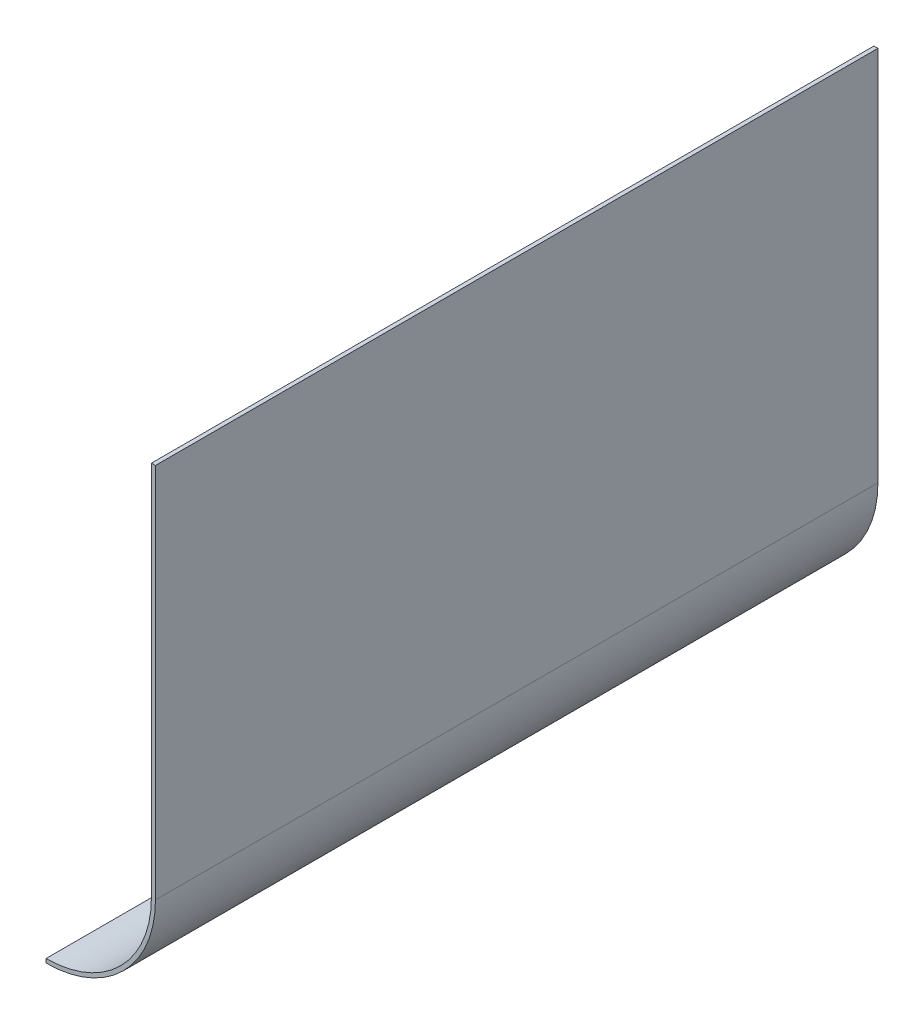
ISO-10303-21;
HEADER;
FILE_DESCRIPTION(('STEP AP214'),'2;1');
FILE_NAME('part.step','',(''),(''),'','','');
FILE_SCHEMA(('AUTOMOTIVE_DESIGN { 1 0 10303 214 1 1 1 1 }'));
ENDSEC;
DATA;
#1=APPLICATION_CONTEXT('core data for automotive mechanical design processes');
#2=APPLICATION_PROTOCOL_DEFINITION('international standard','automotive_design',2000,#1);
#3=PRODUCT_CONTEXT('',#1,'mechanical');
#4=PRODUCT('Part','Part','',(#3));
#5=PRODUCT_RELATED_PRODUCT_CATEGORY('part','',(#4));
#6=PRODUCT_DEFINITION_FORMATION('','',#4);
#7=PRODUCT_DEFINITION_CONTEXT('part definition',#1,'design');
#8=PRODUCT_DEFINITION('design','',#6,#7);
#9=PRODUCT_DEFINITION_SHAPE('','',#8);
#10=(LENGTH_UNIT() NAMED_UNIT(*) SI_UNIT(.MILLI.,.METRE.));
#11=(NAMED_UNIT(*) PLANE_ANGLE_UNIT() SI_UNIT($,.RADIAN.));
#12=(NAMED_UNIT(*) SI_UNIT($,.STERADIAN.) SOLID_ANGLE_UNIT());
#13=UNCERTAINTY_MEASURE_WITH_UNIT(LENGTH_MEASURE(1.E-05),#10,'distance_accuracy_value','');
#14=(GEOMETRIC_REPRESENTATION_CONTEXT(3) GLOBAL_UNCERTAINTY_ASSIGNED_CONTEXT((#13)) GLOBAL_UNIT_ASSIGNED_CONTEXT((#10,
#11,#12)) REPRESENTATION_CONTEXT('',''));
#15=CARTESIAN_POINT('',(0.,0.,0.));
#16=DIRECTION('',(0.,0.,1.));
#17=DIRECTION('',(1.,0.,0.));
#18=AXIS2_PLACEMENT_3D('',#15,#16,#17);
#19=CARTESIAN_POINT('',(69.215,238.125,457.2));
#20=DIRECTION('',(-1.,0.,0.));
#21=DIRECTION('',(0.,-1.,0.));
#22=AXIS2_PLACEMENT_3D('',#19,#20,#21);
#23=PLANE('',#22);
#24=DIRECTION('',(0.,1.,0.));
#25=VECTOR('',#24,1.);
#26=CARTESIAN_POINT('',(69.215,238.125,0.));
#27=LINE('',#26,#25);
#28=CARTESIAN_POINT('',(69.215,0.,0.));
#29=VERTEX_POINT('',#28);
#30=CARTESIAN_POINT('',(69.215,238.125,0.));
#31=VERTEX_POINT('',#30);
#32=EDGE_CURVE('E114',#29,#31,#27,.T.);
#33=ORIENTED_EDGE('',*,*,#32,.T.);
#34=DIRECTION('',(0.,0.,-1.));
#35=VECTOR('',#34,1.);
#36=CARTESIAN_POINT('',(69.215,238.125,457.2));
#37=LINE('',#36,#35);
#38=CARTESIAN_POINT('',(69.215,238.125,457.2));
#39=VERTEX_POINT('',#38);
#40=EDGE_CURVE('E11',#39,#31,#37,.T.);
#41=ORIENTED_EDGE('',*,*,#40,.F.);
#42=DIRECTION('',(0.,1.,0.));
#43=VECTOR('',#42,1.);
#44=CARTESIAN_POINT('',(69.215,238.125,457.2));
#45=LINE('',#44,#43);
#46=CARTESIAN_POINT('',(69.215,0.,457.2));
#47=VERTEX_POINT('',#46);
#48=EDGE_CURVE('E79',#47,#39,#45,.T.);
#49=ORIENTED_EDGE('',*,*,#48,.F.);
#50=DIRECTION('',(0.,0.,-1.));
#51=VECTOR('',#50,1.);
#52=CARTESIAN_POINT('',(69.215,0.,457.2));
#53=LINE('',#52,#51);
#54=EDGE_CURVE('E110',#47,#29,#53,.T.);
#55=ORIENTED_EDGE('',*,*,#54,.T.);
#56=EDGE_LOOP('',(#33,#41,#49,#55));
#57=FACE_BOUND('',#56,.T.);
#58=ADVANCED_FACE('F33',(#57),#23,.F.);
#59=CARTESIAN_POINT('',(66.675,238.125,457.2));
#60=DIRECTION('',(0.,1.,0.));
#61=DIRECTION('',(0.,0.,1.));
#62=AXIS2_PLACEMENT_3D('',#59,#60,#61);
#63=PLANE('',#62);
#64=DIRECTION('',(1.,0.,0.));
#65=VECTOR('',#64,1.);
#66=CARTESIAN_POINT('',(66.675,238.125,0.));
#67=LINE('',#66,#65);
#68=CARTESIAN_POINT('',(66.675,238.125,0.));
#69=VERTEX_POINT('',#68);
#70=EDGE_CURVE('E117',#69,#31,#67,.T.);
#71=ORIENTED_EDGE('',*,*,#70,.F.);
#72=DIRECTION('',(0.,0.,-1.));
#73=VECTOR('',#72,1.);
#74=CARTESIAN_POINT('',(66.675,238.125,457.2));
#75=LINE('',#74,#73);
#76=CARTESIAN_POINT('',(66.675,238.125,457.2));
#77=VERTEX_POINT('',#76);
#78=EDGE_CURVE('E41',#77,#69,#75,.T.);
#79=ORIENTED_EDGE('',*,*,#78,.F.);
#80=DIRECTION('',(1.,0.,0.));
#81=VECTOR('',#80,1.);
#82=CARTESIAN_POINT('',(66.675,238.125,457.2));
#83=LINE('',#82,#81);
#84=EDGE_CURVE('E203',#77,#39,#83,.T.);
#85=ORIENTED_EDGE('',*,*,#84,.T.);
#86=ORIENTED_EDGE('',*,*,#40,.T.);
#87=EDGE_LOOP('',(#71,#79,#85,#86));
#88=FACE_BOUND('',#87,.T.);
#89=ADVANCED_FACE('F135',(#88),#63,.T.);
#90=CARTESIAN_POINT('',(66.675,238.125,457.2));
#91=DIRECTION('',(-1.,0.,0.));
#92=DIRECTION('',(0.,-1.,0.));
#93=AXIS2_PLACEMENT_3D('',#90,#91,#92);
#94=PLANE('',#93);
#95=DIRECTION('',(0.,1.,0.));
#96=VECTOR('',#95,1.);
#97=CARTESIAN_POINT('',(66.675,238.125,0.));
#98=LINE('',#97,#96);
#99=CARTESIAN_POINT('',(66.675,0.,0.));
#100=VERTEX_POINT('',#99);
#101=EDGE_CURVE('E120',#100,#69,#98,.T.);
#102=ORIENTED_EDGE('',*,*,#101,.F.);
#103=DIRECTION('',(0.,0.,-1.));
#104=VECTOR('',#103,1.);
#105=CARTESIAN_POINT('',(66.675,0.,457.2));
#106=LINE('',#105,#104);
#107=CARTESIAN_POINT('',(66.675,0.,457.2));
#108=VERTEX_POINT('',#107);
#109=EDGE_CURVE('E100',#108,#100,#106,.T.);
#110=ORIENTED_EDGE('',*,*,#109,.F.);
#111=DIRECTION('',(0.,1.,0.));
#112=VECTOR('',#111,1.);
#113=CARTESIAN_POINT('',(66.675,238.125,457.2));
#114=LINE('',#113,#112);
#115=EDGE_CURVE('E106',#108,#77,#114,.T.);
#116=ORIENTED_EDGE('',*,*,#115,.T.);
#117=ORIENTED_EDGE('',*,*,#78,.T.);
#118=EDGE_LOOP('',(#102,#110,#116,#117));
#119=FACE_BOUND('',#118,.T.);
#120=ADVANCED_FACE('F132',(#119),#94,.T.);
#121=CARTESIAN_POINT('',(0.,0.,457.2));
#122=DIRECTION('',(0.,0.,-1.));
#123=DIRECTION('',(-1.,0.,0.));
#124=AXIS2_PLACEMENT_3D('',#121,#122,#123);
#125=CYLINDRICAL_SURFACE('',#124,66.675);
#126=CARTESIAN_POINT('',(0.,0.,0.));
#127=DIRECTION('',(0.,0.,1.));
#128=DIRECTION('',(1.,0.,0.));
#129=AXIS2_PLACEMENT_3D('',#126,#127,#128);
#130=CIRCLE('',#129,66.675);
#131=CARTESIAN_POINT('',(0.,-66.675,0.));
#132=VERTEX_POINT('',#131);
#133=EDGE_CURVE('E95',#132,#100,#130,.T.);
#134=ORIENTED_EDGE('',*,*,#133,.F.);
#135=DIRECTION('',(0.,0.,-1.));
#136=VECTOR('',#135,1.);
#137=CARTESIAN_POINT('',(0.,-66.675,457.2));
#138=LINE('',#137,#136);
#139=CARTESIAN_POINT('',(0.,-66.675,457.2));
#140=VERTEX_POINT('',#139);
#141=EDGE_CURVE('E90',#140,#132,#138,.T.);
#142=ORIENTED_EDGE('',*,*,#141,.F.);
#143=CARTESIAN_POINT('',(0.,0.,457.2));
#144=DIRECTION('',(0.,0.,1.));
#145=DIRECTION('',(1.,0.,0.));
#146=AXIS2_PLACEMENT_3D('',#143,#144,#145);
#147=CIRCLE('',#146,66.675);
#148=EDGE_CURVE('E93',#140,#108,#147,.T.);
#149=ORIENTED_EDGE('',*,*,#148,.T.);
#150=ORIENTED_EDGE('',*,*,#109,.T.);
#151=EDGE_LOOP('',(#134,#142,#149,#150));
#152=FACE_BOUND('',#151,.T.);
#153=ADVANCED_FACE('F92',(#152),#125,.F.);
#154=CARTESIAN_POINT('',(0.,-69.215,457.2));
#155=DIRECTION('',(-1.,0.,0.));
#156=DIRECTION('',(0.,-1.,0.));
#157=AXIS2_PLACEMENT_3D('',#154,#155,#156);
#158=PLANE('',#157);
#159=DIRECTION('',(0.,1.,0.));
#160=VECTOR('',#159,1.);
#161=CARTESIAN_POINT('',(0.,-69.215,0.));
#162=LINE('',#161,#160);
#163=CARTESIAN_POINT('',(0.,-69.215,0.));
#164=VERTEX_POINT('',#163);
#165=EDGE_CURVE('E124',#164,#132,#162,.T.);
#166=ORIENTED_EDGE('',*,*,#165,.F.);
#167=DIRECTION('',(0.,0.,-1.));
#168=VECTOR('',#167,1.);
#169=CARTESIAN_POINT('',(0.,-69.215,457.2));
#170=LINE('',#169,#168);
#171=CARTESIAN_POINT('',(0.,-69.215,457.2));
#172=VERTEX_POINT('',#171);
#173=EDGE_CURVE('E70',#172,#164,#170,.T.);
#174=ORIENTED_EDGE('',*,*,#173,.F.);
#175=DIRECTION('',(0.,1.,0.));
#176=VECTOR('',#175,1.);
#177=CARTESIAN_POINT('',(0.,-69.215,457.2));
#178=LINE('',#177,#176);
#179=EDGE_CURVE('E104',#172,#140,#178,.T.);
#180=ORIENTED_EDGE('',*,*,#179,.T.);
#181=ORIENTED_EDGE('',*,*,#141,.T.);
#182=EDGE_LOOP('',(#166,#174,#180,#181));
#183=FACE_BOUND('',#182,.T.);
#184=ADVANCED_FACE('F108',(#183),#158,.T.);
#185=CARTESIAN_POINT('',(0.,0.,457.2));
#186=DIRECTION('',(0.,0.,-1.));
#187=DIRECTION('',(-1.,0.,0.));
#188=AXIS2_PLACEMENT_3D('',#185,#186,#187);
#189=CYLINDRICAL_SURFACE('',#188,69.215);
#190=CARTESIAN_POINT('',(0.,0.,0.));
#191=DIRECTION('',(0.,0.,1.));
#192=DIRECTION('',(1.,0.,0.));
#193=AXIS2_PLACEMENT_3D('',#190,#191,#192);
#194=CIRCLE('',#193,69.215);
#195=EDGE_CURVE('E73',#164,#29,#194,.T.);
#196=ORIENTED_EDGE('',*,*,#195,.T.);
#197=ORIENTED_EDGE('',*,*,#54,.F.);
#198=CARTESIAN_POINT('',(0.,0.,457.2));
#199=DIRECTION('',(0.,0.,1.));
#200=DIRECTION('',(1.,0.,0.));
#201=AXIS2_PLACEMENT_3D('',#198,#199,#200);
#202=CIRCLE('',#201,69.215);
#203=EDGE_CURVE('E49',#172,#47,#202,.T.);
#204=ORIENTED_EDGE('',*,*,#203,.F.);
#205=ORIENTED_EDGE('',*,*,#173,.T.);
#206=EDGE_LOOP('',(#196,#197,#204,#205));
#207=FACE_BOUND('',#206,.T.);
#208=ADVANCED_FACE('F140',(#207),#189,.T.);
#209=CARTESIAN_POINT('',(0.,0.,457.2));
#210=DIRECTION('',(0.,0.,1.));
#211=DIRECTION('',(1.,0.,0.));
#212=AXIS2_PLACEMENT_3D('',#209,#210,#211);
#213=PLANE('',#212);
#214=ORIENTED_EDGE('',*,*,#48,.T.);
#215=ORIENTED_EDGE('',*,*,#84,.F.);
#216=ORIENTED_EDGE('',*,*,#115,.F.);
#217=ORIENTED_EDGE('',*,*,#148,.F.);
#218=ORIENTED_EDGE('',*,*,#179,.F.);
#219=ORIENTED_EDGE('',*,*,#203,.T.);
#220=EDGE_LOOP('',(#214,#215,#216,#217,#218,#219));
#221=FACE_BOUND('',#220,.T.);
#222=ADVANCED_FACE('F103',(#221),#213,.T.);
#223=CARTESIAN_POINT('',(0.,0.,0.));
#224=DIRECTION('',(0.,0.,1.));
#225=DIRECTION('',(1.,0.,0.));
#226=AXIS2_PLACEMENT_3D('',#223,#224,#225);
#227=PLANE('',#226);
#228=ORIENTED_EDGE('',*,*,#32,.F.);
#229=ORIENTED_EDGE('',*,*,#195,.F.);
#230=ORIENTED_EDGE('',*,*,#165,.T.);
#231=ORIENTED_EDGE('',*,*,#133,.T.);
#232=ORIENTED_EDGE('',*,*,#101,.T.);
#233=ORIENTED_EDGE('',*,*,#70,.T.);
#234=EDGE_LOOP('',(#228,#229,#230,#231,#232,#233));
#235=FACE_BOUND('',#234,.T.);
#236=ADVANCED_FACE('F138',(#235),#227,.F.);
#237=CLOSED_SHELL('',(#58,#89,#120,#153,#184,#208,#222,#236));
#238=MANIFOLD_SOLID_BREP('B2',#237);
#239=ADVANCED_BREP_SHAPE_REPRESENTATION('',(#18,#238),#14);
#240=SHAPE_DEFINITION_REPRESENTATION(#9,#239);
ENDSEC;
END-ISO-10303-21;
